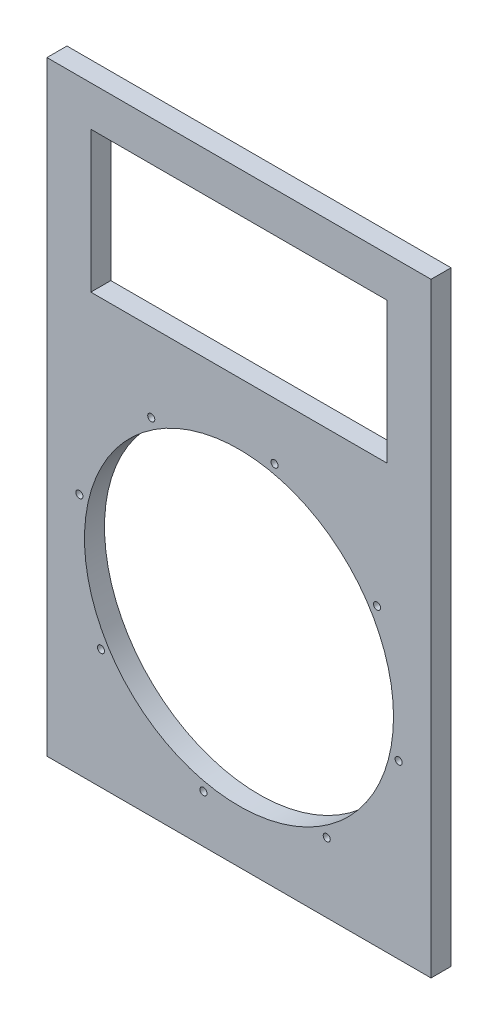
ISO-10303-21;
HEADER;
FILE_DESCRIPTION(('STEP AP214'),'2;1');
FILE_NAME('part.step','',(''),(''),'','','');
FILE_SCHEMA(('AUTOMOTIVE_DESIGN { 1 0 10303 214 1 1 1 1 }'));
ENDSEC;
DATA;
#1=APPLICATION_CONTEXT('core data for automotive mechanical design processes');
#2=APPLICATION_PROTOCOL_DEFINITION('international standard','automotive_design',2000,#1);
#3=PRODUCT_CONTEXT('',#1,'mechanical');
#4=PRODUCT('Part','Part','',(#3));
#5=PRODUCT_RELATED_PRODUCT_CATEGORY('part','',(#4));
#6=PRODUCT_DEFINITION_FORMATION('','',#4);
#7=PRODUCT_DEFINITION_CONTEXT('part definition',#1,'design');
#8=PRODUCT_DEFINITION('design','',#6,#7);
#9=PRODUCT_DEFINITION_SHAPE('','',#8);
#10=(LENGTH_UNIT() NAMED_UNIT(*) SI_UNIT(.MILLI.,.METRE.));
#11=(NAMED_UNIT(*) PLANE_ANGLE_UNIT() SI_UNIT($,.RADIAN.));
#12=(NAMED_UNIT(*) SI_UNIT($,.STERADIAN.) SOLID_ANGLE_UNIT());
#13=UNCERTAINTY_MEASURE_WITH_UNIT(LENGTH_MEASURE(1.E-05),#10,'distance_accuracy_value','');
#14=(GEOMETRIC_REPRESENTATION_CONTEXT(3) GLOBAL_UNCERTAINTY_ASSIGNED_CONTEXT((#13)) GLOBAL_UNIT_ASSIGNED_CONTEXT((#10,
#11,#12)) REPRESENTATION_CONTEXT('',''));
#15=CARTESIAN_POINT('',(0.,0.,0.));
#16=DIRECTION('',(0.,0.,1.));
#17=DIRECTION('',(1.,0.,0.));
#18=AXIS2_PLACEMENT_3D('',#15,#16,#17);
#19=CARTESIAN_POINT('',(0.,0.,18.));
#20=DIRECTION('',(1.,0.,0.));
#21=DIRECTION('',(0.,0.,-1.));
#22=AXIS2_PLACEMENT_3D('',#19,#20,#21);
#23=PLANE('',#22);
#24=DIRECTION('',(0.,-1.,0.));
#25=VECTOR('',#24,1.);
#26=CARTESIAN_POINT('',(0.,0.,0.));
#27=LINE('',#26,#25);
#28=CARTESIAN_POINT('',(0.,544.6,0.));
#29=VERTEX_POINT('',#28);
#30=CARTESIAN_POINT('',(0.,0.,0.));
#31=VERTEX_POINT('',#30);
#32=EDGE_CURVE('E136',#29,#31,#27,.T.);
#33=ORIENTED_EDGE('',*,*,#32,.T.);
#34=DIRECTION('',(0.,0.,-1.));
#35=VECTOR('',#34,1.);
#36=CARTESIAN_POINT('',(0.,0.,18.));
#37=LINE('',#36,#35);
#38=CARTESIAN_POINT('',(0.,0.,18.));
#39=VERTEX_POINT('',#38);
#40=EDGE_CURVE('E11',#39,#31,#37,.T.);
#41=ORIENTED_EDGE('',*,*,#40,.F.);
#42=DIRECTION('',(0.,-1.,0.));
#43=VECTOR('',#42,1.);
#44=CARTESIAN_POINT('',(0.,0.,18.));
#45=LINE('',#44,#43);
#46=CARTESIAN_POINT('',(0.,544.6,18.));
#47=VERTEX_POINT('',#46);
#48=EDGE_CURVE('E140',#47,#39,#45,.T.);
#49=ORIENTED_EDGE('',*,*,#48,.F.);
#50=DIRECTION('',(0.,0.,-1.));
#51=VECTOR('',#50,1.);
#52=CARTESIAN_POINT('',(0.,544.6,18.));
#53=LINE('',#52,#51);
#54=EDGE_CURVE('E150',#47,#29,#53,.T.);
#55=ORIENTED_EDGE('',*,*,#54,.T.);
#56=EDGE_LOOP('',(#33,#41,#49,#55));
#57=FACE_BOUND('',#56,.T.);
#58=ADVANCED_FACE('F35',(#57),#23,.F.);
#59=CARTESIAN_POINT('',(0.,0.,18.));
#60=DIRECTION('',(0.,1.,0.));
#61=DIRECTION('',(0.,0.,1.));
#62=AXIS2_PLACEMENT_3D('',#59,#60,#61);
#63=PLANE('',#62);
#64=DIRECTION('',(1.,0.,0.));
#65=VECTOR('',#64,1.);
#66=CARTESIAN_POINT('',(0.,0.,0.));
#67=LINE('',#66,#65);
#68=CARTESIAN_POINT('',(345.7,0.,0.));
#69=VERTEX_POINT('',#68);
#70=EDGE_CURVE('E153',#31,#69,#67,.T.);
#71=ORIENTED_EDGE('',*,*,#70,.T.);
#72=DIRECTION('',(0.,0.,-1.));
#73=VECTOR('',#72,1.);
#74=CARTESIAN_POINT('',(345.7,0.,18.));
#75=LINE('',#74,#73);
#76=CARTESIAN_POINT('',(345.7,0.,18.));
#77=VERTEX_POINT('',#76);
#78=EDGE_CURVE('E42',#77,#69,#75,.T.);
#79=ORIENTED_EDGE('',*,*,#78,.F.);
#80=DIRECTION('',(1.,0.,0.));
#81=VECTOR('',#80,1.);
#82=CARTESIAN_POINT('',(0.,0.,18.));
#83=LINE('',#82,#81);
#84=EDGE_CURVE('E143',#39,#77,#83,.T.);
#85=ORIENTED_EDGE('',*,*,#84,.F.);
#86=ORIENTED_EDGE('',*,*,#40,.T.);
#87=EDGE_LOOP('',(#71,#79,#85,#86));
#88=FACE_BOUND('',#87,.T.);
#89=ADVANCED_FACE('F181',(#88),#63,.F.);
#90=CARTESIAN_POINT('',(345.7,0.,18.));
#91=DIRECTION('',(-1.,0.,0.));
#92=DIRECTION('',(0.,0.,1.));
#93=AXIS2_PLACEMENT_3D('',#90,#91,#92);
#94=PLANE('',#93);
#95=DIRECTION('',(0.,1.,0.));
#96=VECTOR('',#95,1.);
#97=CARTESIAN_POINT('',(345.7,0.,0.));
#98=LINE('',#97,#96);
#99=CARTESIAN_POINT('',(345.7,544.6,0.));
#100=VERTEX_POINT('',#99);
#101=EDGE_CURVE('E155',#69,#100,#98,.T.);
#102=ORIENTED_EDGE('',*,*,#101,.T.);
#103=DIRECTION('',(0.,0.,-1.));
#104=VECTOR('',#103,1.);
#105=CARTESIAN_POINT('',(345.7,544.6,18.));
#106=LINE('',#105,#104);
#107=CARTESIAN_POINT('',(345.7,544.6,18.));
#108=VERTEX_POINT('',#107);
#109=EDGE_CURVE('E160',#108,#100,#106,.T.);
#110=ORIENTED_EDGE('',*,*,#109,.F.);
#111=DIRECTION('',(0.,1.,0.));
#112=VECTOR('',#111,1.);
#113=CARTESIAN_POINT('',(345.7,0.,18.));
#114=LINE('',#113,#112);
#115=EDGE_CURVE('E146',#77,#108,#114,.T.);
#116=ORIENTED_EDGE('',*,*,#115,.F.);
#117=ORIENTED_EDGE('',*,*,#78,.T.);
#118=EDGE_LOOP('',(#102,#110,#116,#117));
#119=FACE_BOUND('',#118,.T.);
#120=ADVANCED_FACE('F167',(#119),#94,.F.);
#121=CARTESIAN_POINT('',(0.,544.6,18.));
#122=DIRECTION('',(0.,-1.,0.));
#123=DIRECTION('',(0.,0.,-1.));
#124=AXIS2_PLACEMENT_3D('',#121,#122,#123);
#125=PLANE('',#124);
#126=DIRECTION('',(-1.,0.,0.));
#127=VECTOR('',#126,1.);
#128=CARTESIAN_POINT('',(0.,544.6,0.));
#129=LINE('',#128,#127);
#130=EDGE_CURVE('E144',#100,#29,#129,.T.);
#131=ORIENTED_EDGE('',*,*,#130,.T.);
#132=ORIENTED_EDGE('',*,*,#54,.F.);
#133=DIRECTION('',(-1.,0.,0.));
#134=VECTOR('',#133,1.);
#135=CARTESIAN_POINT('',(0.,544.6,18.));
#136=LINE('',#135,#134);
#137=EDGE_CURVE('E148',#108,#47,#136,.T.);
#138=ORIENTED_EDGE('',*,*,#137,.F.);
#139=ORIENTED_EDGE('',*,*,#109,.T.);
#140=EDGE_LOOP('',(#131,#132,#138,#139));
#141=FACE_BOUND('',#140,.T.);
#142=ADVANCED_FACE('F174',(#141),#125,.F.);
#143=CARTESIAN_POINT('',(0.,0.,18.));
#144=DIRECTION('',(0.,0.,-1.));
#145=DIRECTION('',(-1.,0.,0.));
#146=AXIS2_PLACEMENT_3D('',#143,#144,#145);
#147=PLANE('',#146);
#148=CARTESIAN_POINT('',(93.8788571551372,310.905851568658,18.));
#149=DIRECTION('',(0.,0.,1.));
#150=DIRECTION('',(1.,0.,0.));
#151=AXIS2_PLACEMENT_3D('',#148,#149,#150);
#152=CIRCLE('',#151,3.17499999999666);
#153=CARTESIAN_POINT('',(97.0538571551338,310.905851568658,18.));
#154=VERTEX_POINT('',#153);
#155=EDGE_CURVE('E251',#154,#154,#152,.T.);
#156=ORIENTED_EDGE('',*,*,#155,.F.);
#157=EDGE_LOOP('',(#156));
#158=FACE_BOUND('',#157,.T.);
#159=CARTESIAN_POINT('',(29.1757813242883,218.683123227375,18.));
#160=DIRECTION('',(0.,0.,1.));
#161=DIRECTION('',(1.,0.,0.));
#162=AXIS2_PLACEMENT_3D('',#159,#160,#161);
#163=CIRCLE('',#162,3.17499999999039);
#164=CARTESIAN_POINT('',(32.3507813242787,218.683123227375,18.));
#165=VERTEX_POINT('',#164);
#166=EDGE_CURVE('E253',#165,#165,#163,.T.);
#167=ORIENTED_EDGE('',*,*,#166,.F.);
#168=EDGE_LOOP('',(#167));
#169=FACE_BOUND('',#168,.T.);
#170=CARTESIAN_POINT('',(48.6351142303137,107.719822954109,18.));
#171=DIRECTION('',(0.,0.,1.));
#172=DIRECTION('',(1.,0.,0.));
#173=AXIS2_PLACEMENT_3D('',#170,#171,#172);
#174=CIRCLE('',#173,3.17499999998635);
#175=CARTESIAN_POINT('',(51.8101142303,107.719822954109,18.));
#176=VERTEX_POINT('',#175);
#177=EDGE_CURVE('E259',#176,#176,#174,.T.);
#178=ORIENTED_EDGE('',*,*,#177,.F.);
#179=EDGE_LOOP('',(#178));
#180=FACE_BOUND('',#179,.T.);
#181=CARTESIAN_POINT('',(140.857842571597,43.0167471232602,18.));
#182=DIRECTION('',(0.,0.,1.));
#183=DIRECTION('',(1.,0.,0.));
#184=AXIS2_PLACEMENT_3D('',#181,#182,#183);
#185=CIRCLE('',#184,3.1749999999869);
#186=CARTESIAN_POINT('',(144.032842571583,43.0167471232602,18.));
#187=VERTEX_POINT('',#186);
#188=EDGE_CURVE('E265',#187,#187,#185,.T.);
#189=ORIENTED_EDGE('',*,*,#188,.F.);
#190=EDGE_LOOP('',(#189));
#191=FACE_BOUND('',#190,.T.);
#192=CARTESIAN_POINT('',(251.821142844863,62.4760800292856,18.));
#193=DIRECTION('',(0.,0.,1.));
#194=DIRECTION('',(1.,0.,0.));
#195=AXIS2_PLACEMENT_3D('',#192,#193,#194);
#196=CIRCLE('',#195,3.17499999999172);
#197=CARTESIAN_POINT('',(254.996142844855,62.4760800292856,18.));
#198=VERTEX_POINT('',#197);
#199=EDGE_CURVE('E271',#198,#198,#196,.T.);
#200=ORIENTED_EDGE('',*,*,#199,.F.);
#201=EDGE_LOOP('',(#200));
#202=FACE_BOUND('',#201,.T.);
#203=CARTESIAN_POINT('',(316.524218675712,154.698808370568,18.));
#204=DIRECTION('',(0.,0.,1.));
#205=DIRECTION('',(1.,0.,0.));
#206=AXIS2_PLACEMENT_3D('',#203,#204,#205);
#207=CIRCLE('',#206,3.17499999999751);
#208=CARTESIAN_POINT('',(319.699218675709,154.698808370568,18.));
#209=VERTEX_POINT('',#208);
#210=EDGE_CURVE('E277',#209,#209,#207,.T.);
#211=ORIENTED_EDGE('',*,*,#210,.F.);
#212=EDGE_LOOP('',(#211));
#213=FACE_BOUND('',#212,.T.);
#214=CARTESIAN_POINT('',(297.064885769687,265.662108643835,18.));
#215=DIRECTION('',(0.,0.,1.));
#216=DIRECTION('',(1.,0.,0.));
#217=AXIS2_PLACEMENT_3D('',#214,#215,#216);
#218=CIRCLE('',#217,3.175000000001);
#219=CARTESIAN_POINT('',(300.239885769688,265.662108643835,18.));
#220=VERTEX_POINT('',#219);
#221=EDGE_CURVE('E283',#220,#220,#218,.T.);
#222=ORIENTED_EDGE('',*,*,#221,.F.);
#223=EDGE_LOOP('',(#222));
#224=FACE_BOUND('',#223,.T.);
#225=CARTESIAN_POINT('',(204.842157428404,330.365184474684,18.));
#226=DIRECTION('',(0.,0.,1.));
#227=DIRECTION('',(1.,0.,0.));
#228=AXIS2_PLACEMENT_3D('',#225,#226,#227);
#229=CIRCLE('',#228,3.175);
#230=CARTESIAN_POINT('',(208.017157428404,330.365184474684,18.));
#231=VERTEX_POINT('',#230);
#232=EDGE_CURVE('E289',#231,#231,#229,.T.);
#233=ORIENTED_EDGE('',*,*,#232,.F.);
#234=EDGE_LOOP('',(#233));
#235=FACE_BOUND('',#234,.T.);
#236=CARTESIAN_POINT('',(172.85,186.690965798972,18.));
#237=DIRECTION('',(0.,0.,1.));
#238=DIRECTION('',(1.,0.,0.));
#239=AXIS2_PLACEMENT_3D('',#236,#237,#238);
#240=CIRCLE('',#239,139.065);
#241=CARTESIAN_POINT('',(311.915,186.690965798972,18.));
#242=VERTEX_POINT('',#241);
#243=EDGE_CURVE('E123',#242,#242,#240,.T.);
#244=ORIENTED_EDGE('',*,*,#243,.F.);
#245=EDGE_LOOP('',(#244));
#246=FACE_BOUND('',#245,.T.);
#247=DIRECTION('',(1.,0.,0.));
#248=VECTOR('',#247,1.);
#249=CARTESIAN_POINT('',(39.5000000000001,381.5,18.));
#250=LINE('',#249,#248);
#251=CARTESIAN_POINT('',(39.5000000000001,381.5,18.));
#252=VERTEX_POINT('',#251);
#253=CARTESIAN_POINT('',(306.2,381.5,18.));
#254=VERTEX_POINT('',#253);
#255=EDGE_CURVE('E129',#252,#254,#250,.T.);
#256=ORIENTED_EDGE('',*,*,#255,.F.);
#257=DIRECTION('',(0.,-1.,0.));
#258=VECTOR('',#257,1.);
#259=CARTESIAN_POINT('',(39.5,508.5,18.));
#260=LINE('',#259,#258);
#261=CARTESIAN_POINT('',(39.5,508.5,18.));
#262=VERTEX_POINT('',#261);
#263=EDGE_CURVE('E49',#262,#252,#260,.T.);
#264=ORIENTED_EDGE('',*,*,#263,.F.);
#265=DIRECTION('',(-1.,0.,0.));
#266=VECTOR('',#265,1.);
#267=CARTESIAN_POINT('',(39.5,508.5,18.));
#268=LINE('',#267,#266);
#269=CARTESIAN_POINT('',(306.2,508.5,18.));
#270=VERTEX_POINT('',#269);
#271=EDGE_CURVE('E117',#270,#262,#268,.T.);
#272=ORIENTED_EDGE('',*,*,#271,.F.);
#273=DIRECTION('',(0.,1.,0.));
#274=VECTOR('',#273,1.);
#275=CARTESIAN_POINT('',(306.2,508.5,18.));
#276=LINE('',#275,#274);
#277=EDGE_CURVE('E120',#254,#270,#276,.T.);
#278=ORIENTED_EDGE('',*,*,#277,.F.);
#279=EDGE_LOOP('',(#256,#264,#272,#278));
#280=FACE_BOUND('',#279,.T.);
#281=ORIENTED_EDGE('',*,*,#48,.T.);
#282=ORIENTED_EDGE('',*,*,#84,.T.);
#283=ORIENTED_EDGE('',*,*,#115,.T.);
#284=ORIENTED_EDGE('',*,*,#137,.T.);
#285=EDGE_LOOP('',(#281,#282,#283,#284));
#286=FACE_BOUND('',#285,.T.);
#287=ADVANCED_FACE('F180',(#158,#169,#180,#191,#202,#213,#224,#235,#246,#280,#286),#147,.F.);
#288=CARTESIAN_POINT('',(0.,0.,0.));
#289=DIRECTION('',(0.,0.,-1.));
#290=DIRECTION('',(-1.,0.,0.));
#291=AXIS2_PLACEMENT_3D('',#288,#289,#290);
#292=PLANE('',#291);
#293=CARTESIAN_POINT('',(93.8788571551372,310.905851568658,0.));
#294=DIRECTION('',(0.,0.,1.));
#295=DIRECTION('',(1.,0.,0.));
#296=AXIS2_PLACEMENT_3D('',#293,#294,#295);
#297=CIRCLE('',#296,3.17499999999666);
#298=CARTESIAN_POINT('',(97.0538571551338,310.905851568658,0.));
#299=VERTEX_POINT('',#298);
#300=EDGE_CURVE('E248',#299,#299,#297,.T.);
#301=ORIENTED_EDGE('',*,*,#300,.T.);
#302=EDGE_LOOP('',(#301));
#303=FACE_BOUND('',#302,.T.);
#304=CARTESIAN_POINT('',(29.1757813242883,218.683123227375,0.));
#305=DIRECTION('',(0.,0.,1.));
#306=DIRECTION('',(1.,0.,0.));
#307=AXIS2_PLACEMENT_3D('',#304,#305,#306);
#308=CIRCLE('',#307,3.17499999999039);
#309=CARTESIAN_POINT('',(32.3507813242787,218.683123227375,0.));
#310=VERTEX_POINT('',#309);
#311=EDGE_CURVE('E256',#310,#310,#308,.T.);
#312=ORIENTED_EDGE('',*,*,#311,.T.);
#313=EDGE_LOOP('',(#312));
#314=FACE_BOUND('',#313,.T.);
#315=CARTESIAN_POINT('',(48.6351142303137,107.719822954109,0.));
#316=DIRECTION('',(0.,0.,1.));
#317=DIRECTION('',(1.,0.,0.));
#318=AXIS2_PLACEMENT_3D('',#315,#316,#317);
#319=CIRCLE('',#318,3.17499999998635);
#320=CARTESIAN_POINT('',(51.8101142303,107.719822954109,0.));
#321=VERTEX_POINT('',#320);
#322=EDGE_CURVE('E262',#321,#321,#319,.T.);
#323=ORIENTED_EDGE('',*,*,#322,.T.);
#324=EDGE_LOOP('',(#323));
#325=FACE_BOUND('',#324,.T.);
#326=CARTESIAN_POINT('',(140.857842571597,43.0167471232602,0.));
#327=DIRECTION('',(0.,0.,1.));
#328=DIRECTION('',(1.,0.,0.));
#329=AXIS2_PLACEMENT_3D('',#326,#327,#328);
#330=CIRCLE('',#329,3.1749999999869);
#331=CARTESIAN_POINT('',(144.032842571583,43.0167471232602,0.));
#332=VERTEX_POINT('',#331);
#333=EDGE_CURVE('E268',#332,#332,#330,.T.);
#334=ORIENTED_EDGE('',*,*,#333,.T.);
#335=EDGE_LOOP('',(#334));
#336=FACE_BOUND('',#335,.T.);
#337=CARTESIAN_POINT('',(251.821142844863,62.4760800292856,0.));
#338=DIRECTION('',(0.,0.,1.));
#339=DIRECTION('',(1.,0.,0.));
#340=AXIS2_PLACEMENT_3D('',#337,#338,#339);
#341=CIRCLE('',#340,3.17499999999172);
#342=CARTESIAN_POINT('',(254.996142844855,62.4760800292856,0.));
#343=VERTEX_POINT('',#342);
#344=EDGE_CURVE('E274',#343,#343,#341,.T.);
#345=ORIENTED_EDGE('',*,*,#344,.T.);
#346=EDGE_LOOP('',(#345));
#347=FACE_BOUND('',#346,.T.);
#348=CARTESIAN_POINT('',(316.524218675712,154.698808370568,0.));
#349=DIRECTION('',(0.,0.,1.));
#350=DIRECTION('',(1.,0.,0.));
#351=AXIS2_PLACEMENT_3D('',#348,#349,#350);
#352=CIRCLE('',#351,3.17499999999751);
#353=CARTESIAN_POINT('',(319.699218675709,154.698808370568,0.));
#354=VERTEX_POINT('',#353);
#355=EDGE_CURVE('E280',#354,#354,#352,.T.);
#356=ORIENTED_EDGE('',*,*,#355,.T.);
#357=EDGE_LOOP('',(#356));
#358=FACE_BOUND('',#357,.T.);
#359=CARTESIAN_POINT('',(297.064885769687,265.662108643835,0.));
#360=DIRECTION('',(0.,0.,1.));
#361=DIRECTION('',(1.,0.,0.));
#362=AXIS2_PLACEMENT_3D('',#359,#360,#361);
#363=CIRCLE('',#362,3.175000000001);
#364=CARTESIAN_POINT('',(300.239885769688,265.662108643835,0.));
#365=VERTEX_POINT('',#364);
#366=EDGE_CURVE('E286',#365,#365,#363,.T.);
#367=ORIENTED_EDGE('',*,*,#366,.T.);
#368=EDGE_LOOP('',(#367));
#369=FACE_BOUND('',#368,.T.);
#370=CARTESIAN_POINT('',(204.842157428404,330.365184474684,0.));
#371=DIRECTION('',(0.,0.,1.));
#372=DIRECTION('',(1.,0.,0.));
#373=AXIS2_PLACEMENT_3D('',#370,#371,#372);
#374=CIRCLE('',#373,3.175);
#375=CARTESIAN_POINT('',(208.017157428404,330.365184474684,0.));
#376=VERTEX_POINT('',#375);
#377=EDGE_CURVE('E292',#376,#376,#374,.T.);
#378=ORIENTED_EDGE('',*,*,#377,.T.);
#379=EDGE_LOOP('',(#378));
#380=FACE_BOUND('',#379,.T.);
#381=CARTESIAN_POINT('',(172.85,186.690965798972,0.));
#382=DIRECTION('',(0.,0.,1.));
#383=DIRECTION('',(1.,0.,0.));
#384=AXIS2_PLACEMENT_3D('',#381,#382,#383);
#385=CIRCLE('',#384,139.065);
#386=CARTESIAN_POINT('',(311.915,186.690965798972,0.));
#387=VERTEX_POINT('',#386);
#388=EDGE_CURVE('E130',#387,#387,#385,.T.);
#389=ORIENTED_EDGE('',*,*,#388,.T.);
#390=EDGE_LOOP('',(#389));
#391=FACE_BOUND('',#390,.T.);
#392=DIRECTION('',(0.,-1.,0.));
#393=VECTOR('',#392,1.);
#394=CARTESIAN_POINT('',(39.5,508.5,0.));
#395=LINE('',#394,#393);
#396=CARTESIAN_POINT('',(39.5,508.5,0.));
#397=VERTEX_POINT('',#396);
#398=CARTESIAN_POINT('',(39.5000000000001,381.5,0.));
#399=VERTEX_POINT('',#398);
#400=EDGE_CURVE('E101',#397,#399,#395,.T.);
#401=ORIENTED_EDGE('',*,*,#400,.T.);
#402=DIRECTION('',(1.,0.,0.));
#403=VECTOR('',#402,1.);
#404=CARTESIAN_POINT('',(39.5000000000001,381.5,0.));
#405=LINE('',#404,#403);
#406=CARTESIAN_POINT('',(306.2,381.5,0.));
#407=VERTEX_POINT('',#406);
#408=EDGE_CURVE('E110',#399,#407,#405,.T.);
#409=ORIENTED_EDGE('',*,*,#408,.T.);
#410=DIRECTION('',(0.,1.,0.));
#411=VECTOR('',#410,1.);
#412=CARTESIAN_POINT('',(306.2,508.5,0.));
#413=LINE('',#412,#411);
#414=CARTESIAN_POINT('',(306.2,508.5,0.));
#415=VERTEX_POINT('',#414);
#416=EDGE_CURVE('E57',#407,#415,#413,.T.);
#417=ORIENTED_EDGE('',*,*,#416,.T.);
#418=DIRECTION('',(-1.,0.,0.));
#419=VECTOR('',#418,1.);
#420=CARTESIAN_POINT('',(39.5,508.5,0.));
#421=LINE('',#420,#419);
#422=EDGE_CURVE('E107',#415,#397,#421,.T.);
#423=ORIENTED_EDGE('',*,*,#422,.T.);
#424=EDGE_LOOP('',(#401,#409,#417,#423));
#425=FACE_BOUND('',#424,.T.);
#426=ORIENTED_EDGE('',*,*,#32,.F.);
#427=ORIENTED_EDGE('',*,*,#130,.F.);
#428=ORIENTED_EDGE('',*,*,#101,.F.);
#429=ORIENTED_EDGE('',*,*,#70,.F.);
#430=EDGE_LOOP('',(#426,#427,#428,#429));
#431=FACE_BOUND('',#430,.T.);
#432=ADVANCED_FACE('F114',(#303,#314,#325,#336,#347,#358,#369,#380,#391,#425,#431),#292,.T.);
#433=CARTESIAN_POINT('',(39.5,508.5,0.));
#434=DIRECTION('',(-1.,0.,0.));
#435=DIRECTION('',(0.,-1.,0.));
#436=AXIS2_PLACEMENT_3D('',#433,#434,#435);
#437=PLANE('',#436);
#438=ORIENTED_EDGE('',*,*,#263,.T.);
#439=DIRECTION('',(0.,0.,1.));
#440=VECTOR('',#439,1.);
#441=CARTESIAN_POINT('',(39.5000000000001,381.5,0.));
#442=LINE('',#441,#440);
#443=EDGE_CURVE('E97',#399,#252,#442,.T.);
#444=ORIENTED_EDGE('',*,*,#443,.F.);
#445=ORIENTED_EDGE('',*,*,#400,.F.);
#446=DIRECTION('',(0.,0.,1.));
#447=VECTOR('',#446,1.);
#448=CARTESIAN_POINT('',(39.5,508.5,0.));
#449=LINE('',#448,#447);
#450=EDGE_CURVE('E134',#397,#262,#449,.T.);
#451=ORIENTED_EDGE('',*,*,#450,.T.);
#452=EDGE_LOOP('',(#438,#444,#445,#451));
#453=FACE_BOUND('',#452,.T.);
#454=ADVANCED_FACE('F99',(#453),#437,.F.);
#455=CARTESIAN_POINT('',(39.5,508.5,0.));
#456=DIRECTION('',(0.,1.,0.));
#457=DIRECTION('',(0.,0.,1.));
#458=AXIS2_PLACEMENT_3D('',#455,#456,#457);
#459=PLANE('',#458);
#460=ORIENTED_EDGE('',*,*,#271,.T.);
#461=ORIENTED_EDGE('',*,*,#450,.F.);
#462=ORIENTED_EDGE('',*,*,#422,.F.);
#463=DIRECTION('',(0.,0.,1.));
#464=VECTOR('',#463,1.);
#465=CARTESIAN_POINT('',(306.2,508.5,0.));
#466=LINE('',#465,#464);
#467=EDGE_CURVE('E137',#415,#270,#466,.T.);
#468=ORIENTED_EDGE('',*,*,#467,.T.);
#469=EDGE_LOOP('',(#460,#461,#462,#468));
#470=FACE_BOUND('',#469,.T.);
#471=ADVANCED_FACE('F199',(#470),#459,.F.);
#472=CARTESIAN_POINT('',(306.2,508.5,0.));
#473=DIRECTION('',(1.,0.,0.));
#474=DIRECTION('',(0.,1.,0.));
#475=AXIS2_PLACEMENT_3D('',#472,#473,#474);
#476=PLANE('',#475);
#477=ORIENTED_EDGE('',*,*,#277,.T.);
#478=ORIENTED_EDGE('',*,*,#467,.F.);
#479=ORIENTED_EDGE('',*,*,#416,.F.);
#480=DIRECTION('',(0.,0.,1.));
#481=VECTOR('',#480,1.);
#482=CARTESIAN_POINT('',(306.2,381.5,0.));
#483=LINE('',#482,#481);
#484=EDGE_CURVE('E106',#407,#254,#483,.T.);
#485=ORIENTED_EDGE('',*,*,#484,.T.);
#486=EDGE_LOOP('',(#477,#478,#479,#485));
#487=FACE_BOUND('',#486,.T.);
#488=ADVANCED_FACE('F203',(#487),#476,.F.);
#489=CARTESIAN_POINT('',(39.5000000000001,381.5,0.));
#490=DIRECTION('',(0.,-1.,0.));
#491=DIRECTION('',(1.,0.,0.));
#492=AXIS2_PLACEMENT_3D('',#489,#490,#491);
#493=PLANE('',#492);
#494=ORIENTED_EDGE('',*,*,#255,.T.);
#495=ORIENTED_EDGE('',*,*,#484,.F.);
#496=ORIENTED_EDGE('',*,*,#408,.F.);
#497=ORIENTED_EDGE('',*,*,#443,.T.);
#498=EDGE_LOOP('',(#494,#495,#496,#497));
#499=FACE_BOUND('',#498,.T.);
#500=ADVANCED_FACE('F111',(#499),#493,.F.);
#501=CARTESIAN_POINT('',(172.85,186.690965798972,0.));
#502=DIRECTION('',(0.,0.,1.));
#503=DIRECTION('',(1.,0.,0.));
#504=AXIS2_PLACEMENT_3D('',#501,#502,#503);
#505=CYLINDRICAL_SURFACE('',#504,139.065);
#506=ORIENTED_EDGE('',*,*,#388,.F.);
#507=EDGE_LOOP('',(#506));
#508=FACE_BOUND('',#507,.T.);
#509=ORIENTED_EDGE('',*,*,#243,.T.);
#510=EDGE_LOOP('',(#509));
#511=FACE_BOUND('',#510,.T.);
#512=ADVANCED_FACE('F202',(#508,#511),#505,.F.);
#513=CARTESIAN_POINT('',(204.842157428404,330.365184474684,0.));
#514=DIRECTION('',(0.,0.,1.));
#515=DIRECTION('',(1.,0.,0.));
#516=AXIS2_PLACEMENT_3D('',#513,#514,#515);
#517=CYLINDRICAL_SURFACE('',#516,3.175);
#518=ORIENTED_EDGE('',*,*,#377,.F.);
#519=EDGE_LOOP('',(#518));
#520=FACE_BOUND('',#519,.T.);
#521=ORIENTED_EDGE('',*,*,#232,.T.);
#522=EDGE_LOOP('',(#521));
#523=FACE_BOUND('',#522,.T.);
#524=ADVANCED_FACE('F211',(#520,#523),#517,.F.);
#525=CARTESIAN_POINT('',(297.064885769687,265.662108643835,0.));
#526=DIRECTION('',(0.,0.,1.));
#527=DIRECTION('',(1.,0.,0.));
#528=AXIS2_PLACEMENT_3D('',#525,#526,#527);
#529=CYLINDRICAL_SURFACE('',#528,3.175000000001);
#530=ORIENTED_EDGE('',*,*,#366,.F.);
#531=EDGE_LOOP('',(#530));
#532=FACE_BOUND('',#531,.T.);
#533=ORIENTED_EDGE('',*,*,#221,.T.);
#534=EDGE_LOOP('',(#533));
#535=FACE_BOUND('',#534,.T.);
#536=ADVANCED_FACE('F215',(#532,#535),#529,.F.);
#537=CARTESIAN_POINT('',(316.524218675712,154.698808370568,0.));
#538=DIRECTION('',(0.,0.,1.));
#539=DIRECTION('',(1.,0.,0.));
#540=AXIS2_PLACEMENT_3D('',#537,#538,#539);
#541=CYLINDRICAL_SURFACE('',#540,3.17499999999751);
#542=ORIENTED_EDGE('',*,*,#355,.F.);
#543=EDGE_LOOP('',(#542));
#544=FACE_BOUND('',#543,.T.);
#545=ORIENTED_EDGE('',*,*,#210,.T.);
#546=EDGE_LOOP('',(#545));
#547=FACE_BOUND('',#546,.T.);
#548=ADVANCED_FACE('F219',(#544,#547),#541,.F.);
#549=CARTESIAN_POINT('',(251.821142844863,62.4760800292856,0.));
#550=DIRECTION('',(0.,0.,1.));
#551=DIRECTION('',(1.,0.,0.));
#552=AXIS2_PLACEMENT_3D('',#549,#550,#551);
#553=CYLINDRICAL_SURFACE('',#552,3.17499999999172);
#554=ORIENTED_EDGE('',*,*,#344,.F.);
#555=EDGE_LOOP('',(#554));
#556=FACE_BOUND('',#555,.T.);
#557=ORIENTED_EDGE('',*,*,#199,.T.);
#558=EDGE_LOOP('',(#557));
#559=FACE_BOUND('',#558,.T.);
#560=ADVANCED_FACE('F223',(#556,#559),#553,.F.);
#561=CARTESIAN_POINT('',(140.857842571597,43.0167471232602,0.));
#562=DIRECTION('',(0.,0.,1.));
#563=DIRECTION('',(1.,0.,0.));
#564=AXIS2_PLACEMENT_3D('',#561,#562,#563);
#565=CYLINDRICAL_SURFACE('',#564,3.1749999999869);
#566=ORIENTED_EDGE('',*,*,#333,.F.);
#567=EDGE_LOOP('',(#566));
#568=FACE_BOUND('',#567,.T.);
#569=ORIENTED_EDGE('',*,*,#188,.T.);
#570=EDGE_LOOP('',(#569));
#571=FACE_BOUND('',#570,.T.);
#572=ADVANCED_FACE('F227',(#568,#571),#565,.F.);
#573=CARTESIAN_POINT('',(48.6351142303137,107.719822954109,0.));
#574=DIRECTION('',(0.,0.,1.));
#575=DIRECTION('',(1.,0.,0.));
#576=AXIS2_PLACEMENT_3D('',#573,#574,#575);
#577=CYLINDRICAL_SURFACE('',#576,3.17499999998635);
#578=ORIENTED_EDGE('',*,*,#322,.F.);
#579=EDGE_LOOP('',(#578));
#580=FACE_BOUND('',#579,.T.);
#581=ORIENTED_EDGE('',*,*,#177,.T.);
#582=EDGE_LOOP('',(#581));
#583=FACE_BOUND('',#582,.T.);
#584=ADVANCED_FACE('F231',(#580,#583),#577,.F.);
#585=CARTESIAN_POINT('',(29.1757813242883,218.683123227375,0.));
#586=DIRECTION('',(0.,0.,1.));
#587=DIRECTION('',(1.,0.,0.));
#588=AXIS2_PLACEMENT_3D('',#585,#586,#587);
#589=CYLINDRICAL_SURFACE('',#588,3.17499999999039);
#590=ORIENTED_EDGE('',*,*,#311,.F.);
#591=EDGE_LOOP('',(#590));
#592=FACE_BOUND('',#591,.T.);
#593=ORIENTED_EDGE('',*,*,#166,.T.);
#594=EDGE_LOOP('',(#593));
#595=FACE_BOUND('',#594,.T.);
#596=ADVANCED_FACE('F235',(#592,#595),#589,.F.);
#597=CARTESIAN_POINT('',(93.8788571551372,310.905851568658,0.));
#598=DIRECTION('',(0.,0.,1.));
#599=DIRECTION('',(1.,0.,0.));
#600=AXIS2_PLACEMENT_3D('',#597,#598,#599);
#601=CYLINDRICAL_SURFACE('',#600,3.17499999999666);
#602=ORIENTED_EDGE('',*,*,#300,.F.);
#603=EDGE_LOOP('',(#602));
#604=FACE_BOUND('',#603,.T.);
#605=ORIENTED_EDGE('',*,*,#155,.T.);
#606=EDGE_LOOP('',(#605));
#607=FACE_BOUND('',#606,.T.);
#608=ADVANCED_FACE('F239',(#604,#607),#601,.F.);
#609=CLOSED_SHELL('',(#58,#89,#120,#142,#287,#432,#454,#471,#488,#500,#512,#524,#536,#548,#560,
#572,#584,#596,#608));
#610=MANIFOLD_SOLID_BREP('B2',#609);
#611=ADVANCED_BREP_SHAPE_REPRESENTATION('',(#18,#610),#14);
#612=SHAPE_DEFINITION_REPRESENTATION(#9,#611);
ENDSEC;
END-ISO-10303-21;
